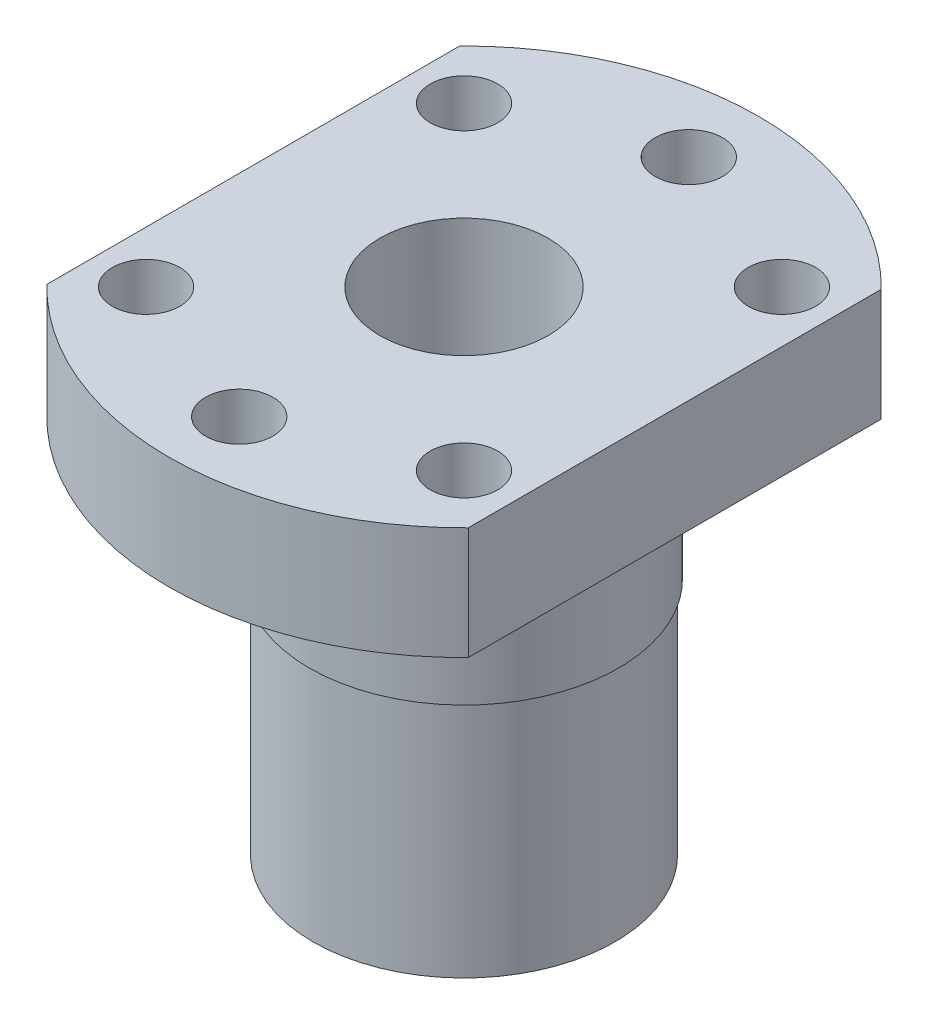
ISO-10303-21;
HEADER;
FILE_DESCRIPTION(('STEP AP214'),'2;1');
FILE_NAME('part.step','',(''),(''),'','','');
FILE_SCHEMA(('AUTOMOTIVE_DESIGN { 1 0 10303 214 1 1 1 1 }'));
ENDSEC;
DATA;
#1=APPLICATION_CONTEXT('core data for automotive mechanical design processes');
#2=APPLICATION_PROTOCOL_DEFINITION('international standard','automotive_design',2000,#1);
#3=PRODUCT_CONTEXT('',#1,'mechanical');
#4=PRODUCT('Part','Part','',(#3));
#5=PRODUCT_RELATED_PRODUCT_CATEGORY('part','',(#4));
#6=PRODUCT_DEFINITION_FORMATION('','',#4);
#7=PRODUCT_DEFINITION_CONTEXT('part definition',#1,'design');
#8=PRODUCT_DEFINITION('design','',#6,#7);
#9=PRODUCT_DEFINITION_SHAPE('','',#8);
#10=(LENGTH_UNIT() NAMED_UNIT(*) SI_UNIT(.MILLI.,.METRE.));
#11=(NAMED_UNIT(*) PLANE_ANGLE_UNIT() SI_UNIT($,.RADIAN.));
#12=(NAMED_UNIT(*) SI_UNIT($,.STERADIAN.) SOLID_ANGLE_UNIT());
#13=UNCERTAINTY_MEASURE_WITH_UNIT(LENGTH_MEASURE(1.E-05),#10,'distance_accuracy_value','');
#14=(GEOMETRIC_REPRESENTATION_CONTEXT(3) GLOBAL_UNCERTAINTY_ASSIGNED_CONTEXT((#13)) GLOBAL_UNIT_ASSIGNED_CONTEXT((#10,
#11,#12)) REPRESENTATION_CONTEXT('',''));
#15=CARTESIAN_POINT('',(0.,0.,0.));
#16=DIRECTION('',(0.,0.,1.));
#17=DIRECTION('',(1.,0.,0.));
#18=AXIS2_PLACEMENT_3D('',#15,#16,#17);
#19=CARTESIAN_POINT('',(0.,-10.,0.));
#20=DIRECTION('',(0.,-1.,0.));
#21=DIRECTION('',(0.,0.,-1.));
#22=AXIS2_PLACEMENT_3D('',#19,#20,#21);
#23=PLANE('',#22);
#24=CARTESIAN_POINT('',(0.,-10.,0.));
#25=DIRECTION('',(0.,-1.,0.));
#26=DIRECTION('',(0.,0.,-1.));
#27=AXIS2_PLACEMENT_3D('',#24,#25,#26);
#28=CIRCLE('',#27,11.);
#29=CARTESIAN_POINT('',(0.,-10.,-11.));
#30=VERTEX_POINT('',#29);
#31=EDGE_CURVE('E168',#30,#30,#28,.T.);
#32=ORIENTED_EDGE('',*,*,#31,.T.);
#33=EDGE_LOOP('',(#32));
#34=FACE_BOUND('',#33,.T.);
#35=CARTESIAN_POINT('',(0.,-10.,0.));
#36=DIRECTION('',(0.,-1.,0.));
#37=DIRECTION('',(0.,0.,-1.));
#38=AXIS2_PLACEMENT_3D('',#35,#36,#37);
#39=CIRCLE('',#38,10.75);
#40=CARTESIAN_POINT('',(0.,-10.,-10.75));
#41=VERTEX_POINT('',#40);
#42=EDGE_CURVE('E165',#41,#41,#39,.T.);
#43=ORIENTED_EDGE('',*,*,#42,.F.);
#44=EDGE_LOOP('',(#43));
#45=FACE_BOUND('',#44,.T.);
#46=ADVANCED_FACE('F32',(#34,#45),#23,.T.);
#47=CARTESIAN_POINT('',(0.,0.,0.));
#48=DIRECTION('',(0.,1.,0.));
#49=DIRECTION('',(0.,0.,1.));
#50=AXIS2_PLACEMENT_3D('',#47,#48,#49);
#51=PLANE('',#50);
#52=CARTESIAN_POINT('',(-11.3137084989848,0.,11.3137084989847));
#53=DIRECTION('',(0.,1.,0.));
#54=DIRECTION('',(0.,0.,-1.));
#55=AXIS2_PLACEMENT_3D('',#52,#53,#54);
#56=CIRCLE('',#55,2.4);
#57=CARTESIAN_POINT('',(-11.3137084989848,0.,8.91370849898474));
#58=VERTEX_POINT('',#57);
#59=EDGE_CURVE('E174',#58,#58,#56,.T.);
#60=ORIENTED_EDGE('',*,*,#59,.T.);
#61=EDGE_LOOP('',(#60));
#62=FACE_BOUND('',#61,.T.);
#63=CARTESIAN_POINT('',(11.3137084989848,0.,11.3137084989847));
#64=DIRECTION('',(0.,1.,0.));
#65=DIRECTION('',(0.,0.,1.));
#66=AXIS2_PLACEMENT_3D('',#63,#64,#65);
#67=CIRCLE('',#66,2.4);
#68=CARTESIAN_POINT('',(11.3137084989848,0.,13.7137084989847));
#69=VERTEX_POINT('',#68);
#70=EDGE_CURVE('E183',#69,#69,#67,.T.);
#71=ORIENTED_EDGE('',*,*,#70,.T.);
#72=EDGE_LOOP('',(#71));
#73=FACE_BOUND('',#72,.T.);
#74=CARTESIAN_POINT('',(-11.3137084989848,0.,-11.3137084989847));
#75=DIRECTION('',(0.,1.,0.));
#76=DIRECTION('',(0.,0.,1.));
#77=AXIS2_PLACEMENT_3D('',#74,#75,#76);
#78=CIRCLE('',#77,2.4);
#79=CARTESIAN_POINT('',(-11.3137084989848,0.,-8.91370849898474));
#80=VERTEX_POINT('',#79);
#81=EDGE_CURVE('E193',#80,#80,#78,.T.);
#82=ORIENTED_EDGE('',*,*,#81,.T.);
#83=EDGE_LOOP('',(#82));
#84=FACE_BOUND('',#83,.T.);
#85=CARTESIAN_POINT('',(0.,0.,0.));
#86=DIRECTION('',(0.,1.,0.));
#87=DIRECTION('',(0.,0.,1.));
#88=AXIS2_PLACEMENT_3D('',#85,#86,#87);
#89=CIRCLE('',#88,21.);
#90=CARTESIAN_POINT('',(-15.,0.,14.6969384566991));
#91=VERTEX_POINT('',#90);
#92=CARTESIAN_POINT('',(15.,0.,14.696938456699));
#93=VERTEX_POINT('',#92);
#94=EDGE_CURVE('E100',#91,#93,#89,.T.);
#95=ORIENTED_EDGE('',*,*,#94,.F.);
#96=DIRECTION('',(0.,0.,1.));
#97=VECTOR('',#96,1.);
#98=CARTESIAN_POINT('',(-15.,0.,-14.6969384566991));
#99=LINE('',#98,#97);
#100=CARTESIAN_POINT('',(-15.,0.,-14.6969384566991));
#101=VERTEX_POINT('',#100);
#102=EDGE_CURVE('E72',#101,#91,#99,.T.);
#103=ORIENTED_EDGE('',*,*,#102,.F.);
#104=CARTESIAN_POINT('',(0.,0.,0.));
#105=DIRECTION('',(0.,1.,0.));
#106=DIRECTION('',(0.,0.,1.));
#107=AXIS2_PLACEMENT_3D('',#104,#105,#106);
#108=CIRCLE('',#107,21.);
#109=CARTESIAN_POINT('',(15.,0.,-14.6969384566991));
#110=VERTEX_POINT('',#109);
#111=EDGE_CURVE('E66',#110,#101,#108,.T.);
#112=ORIENTED_EDGE('',*,*,#111,.F.);
#113=DIRECTION('',(0.,0.,-1.));
#114=VECTOR('',#113,1.);
#115=CARTESIAN_POINT('',(15.,0.,-14.6969384566991));
#116=LINE('',#115,#114);
#117=EDGE_CURVE('E91',#93,#110,#116,.T.);
#118=ORIENTED_EDGE('',*,*,#117,.F.);
#119=EDGE_LOOP('',(#95,#103,#112,#118));
#120=FACE_BOUND('',#119,.T.);
#121=CARTESIAN_POINT('',(0.,0.,-16.));
#122=DIRECTION('',(0.,1.,0.));
#123=DIRECTION('',(0.,0.,1.));
#124=AXIS2_PLACEMENT_3D('',#121,#122,#123);
#125=CIRCLE('',#124,2.4);
#126=CARTESIAN_POINT('',(0.,0.,-13.6));
#127=VERTEX_POINT('',#126);
#128=EDGE_CURVE('E119',#127,#127,#125,.T.);
#129=ORIENTED_EDGE('',*,*,#128,.T.);
#130=EDGE_LOOP('',(#129));
#131=FACE_BOUND('',#130,.T.);
#132=CARTESIAN_POINT('',(11.3137084989848,0.,-11.3137084989847));
#133=DIRECTION('',(0.,1.,0.));
#134=DIRECTION('',(0.,0.,-1.));
#135=AXIS2_PLACEMENT_3D('',#132,#133,#134);
#136=CIRCLE('',#135,2.4);
#137=CARTESIAN_POINT('',(11.3137084989848,0.,-13.7137084989847));
#138=VERTEX_POINT('',#137);
#139=EDGE_CURVE('E123',#138,#138,#136,.T.);
#140=ORIENTED_EDGE('',*,*,#139,.T.);
#141=EDGE_LOOP('',(#140));
#142=FACE_BOUND('',#141,.T.);
#143=CARTESIAN_POINT('',(0.,0.,16.));
#144=DIRECTION('',(0.,1.,0.));
#145=DIRECTION('',(0.,0.,-1.));
#146=AXIS2_PLACEMENT_3D('',#143,#144,#145);
#147=CIRCLE('',#146,2.4);
#148=CARTESIAN_POINT('',(0.,0.,13.6));
#149=VERTEX_POINT('',#148);
#150=EDGE_CURVE('E127',#149,#149,#147,.T.);
#151=ORIENTED_EDGE('',*,*,#150,.T.);
#152=EDGE_LOOP('',(#151));
#153=FACE_BOUND('',#152,.T.);
#154=CARTESIAN_POINT('',(0.,0.,0.));
#155=DIRECTION('',(0.,1.,0.));
#156=DIRECTION('',(0.,0.,1.));
#157=AXIS2_PLACEMENT_3D('',#154,#155,#156);
#158=CIRCLE('',#157,11.);
#159=CARTESIAN_POINT('',(0.,0.,11.));
#160=VERTEX_POINT('',#159);
#161=EDGE_CURVE('E11',#160,#160,#158,.F.);
#162=ORIENTED_EDGE('',*,*,#161,.F.);
#163=EDGE_LOOP('',(#162));
#164=FACE_BOUND('',#163,.T.);
#165=ADVANCED_FACE('F111',(#62,#73,#84,#120,#131,#142,#153,#164),#51,.F.);
#166=CARTESIAN_POINT('',(0.,8.,0.));
#167=DIRECTION('',(0.,1.,0.));
#168=DIRECTION('',(0.,0.,1.));
#169=AXIS2_PLACEMENT_3D('',#166,#167,#168);
#170=PLANE('',#169);
#171=CARTESIAN_POINT('',(0.,8.,16.));
#172=DIRECTION('',(0.,1.,0.));
#173=DIRECTION('',(0.,0.,-1.));
#174=AXIS2_PLACEMENT_3D('',#171,#172,#173);
#175=CIRCLE('',#174,2.4);
#176=CARTESIAN_POINT('',(0.,8.,13.6));
#177=VERTEX_POINT('',#176);
#178=EDGE_CURVE('E180',#177,#177,#175,.T.);
#179=ORIENTED_EDGE('',*,*,#178,.F.);
#180=EDGE_LOOP('',(#179));
#181=FACE_BOUND('',#180,.T.);
#182=CARTESIAN_POINT('',(11.3137084989848,8.,-11.3137084989847));
#183=DIRECTION('',(0.,1.,0.));
#184=DIRECTION('',(0.,0.,-1.));
#185=AXIS2_PLACEMENT_3D('',#182,#183,#184);
#186=CIRCLE('',#185,2.4);
#187=CARTESIAN_POINT('',(11.3137084989848,8.,-13.7137084989847));
#188=VERTEX_POINT('',#187);
#189=EDGE_CURVE('E190',#188,#188,#186,.T.);
#190=ORIENTED_EDGE('',*,*,#189,.F.);
#191=EDGE_LOOP('',(#190));
#192=FACE_BOUND('',#191,.T.);
#193=CARTESIAN_POINT('',(0.,8.,-16.));
#194=DIRECTION('',(0.,1.,0.));
#195=DIRECTION('',(0.,0.,1.));
#196=AXIS2_PLACEMENT_3D('',#193,#194,#195);
#197=CIRCLE('',#196,2.4);
#198=CARTESIAN_POINT('',(0.,8.,-13.6));
#199=VERTEX_POINT('',#198);
#200=EDGE_CURVE('E200',#199,#199,#197,.T.);
#201=ORIENTED_EDGE('',*,*,#200,.F.);
#202=EDGE_LOOP('',(#201));
#203=FACE_BOUND('',#202,.T.);
#204=CARTESIAN_POINT('',(0.,8.,0.));
#205=DIRECTION('',(0.,1.,0.));
#206=DIRECTION('',(0.,0.,1.));
#207=AXIS2_PLACEMENT_3D('',#204,#205,#206);
#208=CIRCLE('',#207,21.);
#209=CARTESIAN_POINT('',(-15.,8.,14.6969384566991));
#210=VERTEX_POINT('',#209);
#211=CARTESIAN_POINT('',(15.,8.,14.696938456699));
#212=VERTEX_POINT('',#211);
#213=EDGE_CURVE('E86',#210,#212,#208,.T.);
#214=ORIENTED_EDGE('',*,*,#213,.T.);
#215=DIRECTION('',(0.,0.,-1.));
#216=VECTOR('',#215,1.);
#217=CARTESIAN_POINT('',(15.,8.,-14.6969384566991));
#218=LINE('',#217,#216);
#219=CARTESIAN_POINT('',(15.,8.,-14.6969384566991));
#220=VERTEX_POINT('',#219);
#221=EDGE_CURVE('E80',#212,#220,#218,.T.);
#222=ORIENTED_EDGE('',*,*,#221,.T.);
#223=CARTESIAN_POINT('',(0.,8.,0.));
#224=DIRECTION('',(0.,1.,0.));
#225=DIRECTION('',(0.,0.,1.));
#226=AXIS2_PLACEMENT_3D('',#223,#224,#225);
#227=CIRCLE('',#226,21.);
#228=CARTESIAN_POINT('',(-15.,8.,-14.6969384566991));
#229=VERTEX_POINT('',#228);
#230=EDGE_CURVE('E84',#220,#229,#227,.T.);
#231=ORIENTED_EDGE('',*,*,#230,.T.);
#232=DIRECTION('',(0.,0.,1.));
#233=VECTOR('',#232,1.);
#234=CARTESIAN_POINT('',(-15.,8.,-14.6969384566991));
#235=LINE('',#234,#233);
#236=EDGE_CURVE('E49',#229,#210,#235,.T.);
#237=ORIENTED_EDGE('',*,*,#236,.T.);
#238=EDGE_LOOP('',(#214,#222,#231,#237));
#239=FACE_BOUND('',#238,.T.);
#240=CARTESIAN_POINT('',(0.,8.,0.));
#241=DIRECTION('',(0.,1.,0.));
#242=DIRECTION('',(0.,0.,1.));
#243=AXIS2_PLACEMENT_3D('',#240,#241,#242);
#244=CIRCLE('',#243,6.);
#245=CARTESIAN_POINT('',(0.,8.,6.));
#246=VERTEX_POINT('',#245);
#247=EDGE_CURVE('E103',#246,#246,#244,.T.);
#248=ORIENTED_EDGE('',*,*,#247,.F.);
#249=EDGE_LOOP('',(#248));
#250=FACE_BOUND('',#249,.T.);
#251=CARTESIAN_POINT('',(-11.3137084989848,8.,-11.3137084989847));
#252=DIRECTION('',(0.,1.,0.));
#253=DIRECTION('',(0.,0.,1.));
#254=AXIS2_PLACEMENT_3D('',#251,#252,#253);
#255=CIRCLE('',#254,2.4);
#256=CARTESIAN_POINT('',(-11.3137084989848,8.,-8.91370849898474));
#257=VERTEX_POINT('',#256);
#258=EDGE_CURVE('E195',#257,#257,#255,.T.);
#259=ORIENTED_EDGE('',*,*,#258,.F.);
#260=EDGE_LOOP('',(#259));
#261=FACE_BOUND('',#260,.T.);
#262=CARTESIAN_POINT('',(11.3137084989848,8.,11.3137084989847));
#263=DIRECTION('',(0.,1.,0.));
#264=DIRECTION('',(0.,0.,1.));
#265=AXIS2_PLACEMENT_3D('',#262,#263,#264);
#266=CIRCLE('',#265,2.4);
#267=CARTESIAN_POINT('',(11.3137084989848,8.,13.7137084989847));
#268=VERTEX_POINT('',#267);
#269=EDGE_CURVE('E185',#268,#268,#266,.T.);
#270=ORIENTED_EDGE('',*,*,#269,.F.);
#271=EDGE_LOOP('',(#270));
#272=FACE_BOUND('',#271,.T.);
#273=CARTESIAN_POINT('',(-11.3137084989848,8.,11.3137084989847));
#274=DIRECTION('',(0.,1.,0.));
#275=DIRECTION('',(0.,0.,-1.));
#276=AXIS2_PLACEMENT_3D('',#273,#274,#275);
#277=CIRCLE('',#276,2.4);
#278=CARTESIAN_POINT('',(-11.3137084989848,8.,8.91370849898474));
#279=VERTEX_POINT('',#278);
#280=EDGE_CURVE('E175',#279,#279,#277,.T.);
#281=ORIENTED_EDGE('',*,*,#280,.F.);
#282=EDGE_LOOP('',(#281));
#283=FACE_BOUND('',#282,.T.);
#284=ADVANCED_FACE('F81',(#181,#192,#203,#239,#250,#261,#272,#283),#170,.T.);
#285=CARTESIAN_POINT('',(0.,8.,0.));
#286=DIRECTION('',(0.,-1.,0.));
#287=DIRECTION('',(0.,0.,-1.));
#288=AXIS2_PLACEMENT_3D('',#285,#286,#287);
#289=CYLINDRICAL_SURFACE('',#288,21.);
#290=ORIENTED_EDGE('',*,*,#94,.T.);
#291=DIRECTION('',(0.,-1.,0.));
#292=VECTOR('',#291,1.);
#293=CARTESIAN_POINT('',(15.,8.,14.696938456699));
#294=LINE('',#293,#292);
#295=EDGE_CURVE('E41',#212,#93,#294,.T.);
#296=ORIENTED_EDGE('',*,*,#295,.F.);
#297=ORIENTED_EDGE('',*,*,#213,.F.);
#298=DIRECTION('',(0.,-1.,0.));
#299=VECTOR('',#298,1.);
#300=CARTESIAN_POINT('',(-15.,8.,14.6969384566991));
#301=LINE('',#300,#299);
#302=EDGE_CURVE('E96',#210,#91,#301,.T.);
#303=ORIENTED_EDGE('',*,*,#302,.T.);
#304=EDGE_LOOP('',(#290,#296,#297,#303));
#305=FACE_BOUND('',#304,.T.);
#306=ADVANCED_FACE('F34',(#305),#289,.T.);
#307=CARTESIAN_POINT('',(15.,8.,-14.6969384566991));
#308=DIRECTION('',(-1.,0.,0.));
#309=DIRECTION('',(0.,0.,1.));
#310=AXIS2_PLACEMENT_3D('',#307,#308,#309);
#311=PLANE('',#310);
#312=ORIENTED_EDGE('',*,*,#117,.T.);
#313=DIRECTION('',(0.,-1.,0.));
#314=VECTOR('',#313,1.);
#315=CARTESIAN_POINT('',(15.,8.,-14.6969384566991));
#316=LINE('',#315,#314);
#317=EDGE_CURVE('E89',#220,#110,#316,.T.);
#318=ORIENTED_EDGE('',*,*,#317,.F.);
#319=ORIENTED_EDGE('',*,*,#221,.F.);
#320=ORIENTED_EDGE('',*,*,#295,.T.);
#321=EDGE_LOOP('',(#312,#318,#319,#320));
#322=FACE_BOUND('',#321,.T.);
#323=ADVANCED_FACE('F90',(#322),#311,.F.);
#324=CARTESIAN_POINT('',(0.,8.,0.));
#325=DIRECTION('',(0.,-1.,0.));
#326=DIRECTION('',(0.,0.,-1.));
#327=AXIS2_PLACEMENT_3D('',#324,#325,#326);
#328=CYLINDRICAL_SURFACE('',#327,21.);
#329=ORIENTED_EDGE('',*,*,#111,.T.);
#330=DIRECTION('',(0.,-1.,0.));
#331=VECTOR('',#330,1.);
#332=CARTESIAN_POINT('',(-15.,8.,-14.6969384566991));
#333=LINE('',#332,#331);
#334=EDGE_CURVE('E92',#229,#101,#333,.T.);
#335=ORIENTED_EDGE('',*,*,#334,.F.);
#336=ORIENTED_EDGE('',*,*,#230,.F.);
#337=ORIENTED_EDGE('',*,*,#317,.T.);
#338=EDGE_LOOP('',(#329,#335,#336,#337));
#339=FACE_BOUND('',#338,.T.);
#340=ADVANCED_FACE('F94',(#339),#328,.T.);
#341=CARTESIAN_POINT('',(-15.,8.,-14.6969384566991));
#342=DIRECTION('',(1.,0.,0.));
#343=DIRECTION('',(0.,0.,-1.));
#344=AXIS2_PLACEMENT_3D('',#341,#342,#343);
#345=PLANE('',#344);
#346=ORIENTED_EDGE('',*,*,#102,.T.);
#347=ORIENTED_EDGE('',*,*,#302,.F.);
#348=ORIENTED_EDGE('',*,*,#236,.F.);
#349=ORIENTED_EDGE('',*,*,#334,.T.);
#350=EDGE_LOOP('',(#346,#347,#348,#349));
#351=FACE_BOUND('',#350,.T.);
#352=ADVANCED_FACE('F243',(#351),#345,.F.);
#353=CARTESIAN_POINT('',(0.,8.,0.));
#354=DIRECTION('',(0.,-1.,0.));
#355=DIRECTION('',(0.,0.,-1.));
#356=AXIS2_PLACEMENT_3D('',#353,#354,#355);
#357=CYLINDRICAL_SURFACE('',#356,6.);
#358=ORIENTED_EDGE('',*,*,#247,.T.);
#359=EDGE_LOOP('',(#358));
#360=FACE_BOUND('',#359,.T.);
#361=CARTESIAN_POINT('',(0.,-27.,0.));
#362=DIRECTION('',(0.,-1.,0.));
#363=DIRECTION('',(0.,0.,-1.));
#364=AXIS2_PLACEMENT_3D('',#361,#362,#363);
#365=CIRCLE('',#364,6.);
#366=CARTESIAN_POINT('',(0.,-27.,-6.));
#367=VERTEX_POINT('',#366);
#368=EDGE_CURVE('E166',#367,#367,#365,.T.);
#369=ORIENTED_EDGE('',*,*,#368,.T.);
#370=EDGE_LOOP('',(#369));
#371=FACE_BOUND('',#370,.T.);
#372=ADVANCED_FACE('F207',(#360,#371),#357,.F.);
#373=CARTESIAN_POINT('',(0.,8.,-16.));
#374=DIRECTION('',(0.,-1.,0.));
#375=DIRECTION('',(0.,0.,-1.));
#376=AXIS2_PLACEMENT_3D('',#373,#374,#375);
#377=CYLINDRICAL_SURFACE('',#376,2.4);
#378=ORIENTED_EDGE('',*,*,#200,.T.);
#379=EDGE_LOOP('',(#378));
#380=FACE_BOUND('',#379,.T.);
#381=ORIENTED_EDGE('',*,*,#128,.F.);
#382=EDGE_LOOP('',(#381));
#383=FACE_BOUND('',#382,.T.);
#384=ADVANCED_FACE('F228',(#380,#383),#377,.F.);
#385=CARTESIAN_POINT('',(-11.3137084989848,8.,-11.3137084989847));
#386=DIRECTION('',(0.,-1.,0.));
#387=DIRECTION('',(0.,0.,-1.));
#388=AXIS2_PLACEMENT_3D('',#385,#386,#387);
#389=CYLINDRICAL_SURFACE('',#388,2.4);
#390=ORIENTED_EDGE('',*,*,#258,.T.);
#391=EDGE_LOOP('',(#390));
#392=FACE_BOUND('',#391,.T.);
#393=ORIENTED_EDGE('',*,*,#81,.F.);
#394=EDGE_LOOP('',(#393));
#395=FACE_BOUND('',#394,.T.);
#396=ADVANCED_FACE('F225',(#392,#395),#389,.F.);
#397=CARTESIAN_POINT('',(11.3137084989848,8.,-11.3137084989847));
#398=DIRECTION('',(0.,-1.,0.));
#399=DIRECTION('',(0.,0.,-1.));
#400=AXIS2_PLACEMENT_3D('',#397,#398,#399);
#401=CYLINDRICAL_SURFACE('',#400,2.4);
#402=ORIENTED_EDGE('',*,*,#189,.T.);
#403=EDGE_LOOP('',(#402));
#404=FACE_BOUND('',#403,.T.);
#405=ORIENTED_EDGE('',*,*,#139,.F.);
#406=EDGE_LOOP('',(#405));
#407=FACE_BOUND('',#406,.T.);
#408=ADVANCED_FACE('F227',(#404,#407),#401,.F.);
#409=CARTESIAN_POINT('',(11.3137084989848,8.,11.3137084989847));
#410=DIRECTION('',(0.,-1.,0.));
#411=DIRECTION('',(0.,0.,-1.));
#412=AXIS2_PLACEMENT_3D('',#409,#410,#411);
#413=CYLINDRICAL_SURFACE('',#412,2.4);
#414=ORIENTED_EDGE('',*,*,#269,.T.);
#415=EDGE_LOOP('',(#414));
#416=FACE_BOUND('',#415,.T.);
#417=ORIENTED_EDGE('',*,*,#70,.F.);
#418=EDGE_LOOP('',(#417));
#419=FACE_BOUND('',#418,.T.);
#420=ADVANCED_FACE('F235',(#416,#419),#413,.F.);
#421=CARTESIAN_POINT('',(0.,8.,16.));
#422=DIRECTION('',(0.,-1.,0.));
#423=DIRECTION('',(0.,0.,-1.));
#424=AXIS2_PLACEMENT_3D('',#421,#422,#423);
#425=CYLINDRICAL_SURFACE('',#424,2.4);
#426=ORIENTED_EDGE('',*,*,#178,.T.);
#427=EDGE_LOOP('',(#426));
#428=FACE_BOUND('',#427,.T.);
#429=ORIENTED_EDGE('',*,*,#150,.F.);
#430=EDGE_LOOP('',(#429));
#431=FACE_BOUND('',#430,.T.);
#432=ADVANCED_FACE('F143',(#428,#431),#425,.F.);
#433=CARTESIAN_POINT('',(-11.3137084989848,8.,11.3137084989847));
#434=DIRECTION('',(0.,-1.,0.));
#435=DIRECTION('',(0.,0.,-1.));
#436=AXIS2_PLACEMENT_3D('',#433,#434,#435);
#437=CYLINDRICAL_SURFACE('',#436,2.4);
#438=ORIENTED_EDGE('',*,*,#280,.T.);
#439=EDGE_LOOP('',(#438));
#440=FACE_BOUND('',#439,.T.);
#441=ORIENTED_EDGE('',*,*,#59,.F.);
#442=EDGE_LOOP('',(#441));
#443=FACE_BOUND('',#442,.T.);
#444=ADVANCED_FACE('F133',(#440,#443),#437,.F.);
#445=CARTESIAN_POINT('',(0.,-10.,0.));
#446=DIRECTION('',(0.,1.,0.));
#447=DIRECTION('',(0.,0.,1.));
#448=AXIS2_PLACEMENT_3D('',#445,#446,#447);
#449=CYLINDRICAL_SURFACE('',#448,11.);
#450=ORIENTED_EDGE('',*,*,#31,.F.);
#451=EDGE_LOOP('',(#450));
#452=FACE_BOUND('',#451,.T.);
#453=ORIENTED_EDGE('',*,*,#161,.T.);
#454=EDGE_LOOP('',(#453));
#455=FACE_BOUND('',#454,.T.);
#456=ADVANCED_FACE('F130',(#452,#455),#449,.T.);
#457=CARTESIAN_POINT('',(0.,-27.,0.));
#458=DIRECTION('',(0.,-1.,0.));
#459=DIRECTION('',(0.,0.,-1.));
#460=AXIS2_PLACEMENT_3D('',#457,#458,#459);
#461=PLANE('',#460);
#462=CARTESIAN_POINT('',(0.,-27.,0.));
#463=DIRECTION('',(0.,-1.,0.));
#464=DIRECTION('',(0.,0.,-1.));
#465=AXIS2_PLACEMENT_3D('',#462,#463,#464);
#466=CIRCLE('',#465,10.75);
#467=CARTESIAN_POINT('',(0.,-27.,-10.75));
#468=VERTEX_POINT('',#467);
#469=EDGE_CURVE('E162',#468,#468,#466,.T.);
#470=ORIENTED_EDGE('',*,*,#469,.T.);
#471=EDGE_LOOP('',(#470));
#472=FACE_BOUND('',#471,.T.);
#473=ORIENTED_EDGE('',*,*,#368,.F.);
#474=EDGE_LOOP('',(#473));
#475=FACE_BOUND('',#474,.T.);
#476=ADVANCED_FACE('F132',(#472,#475),#461,.T.);
#477=CARTESIAN_POINT('',(0.,-27.,0.));
#478=DIRECTION('',(0.,1.,0.));
#479=DIRECTION('',(0.,0.,1.));
#480=AXIS2_PLACEMENT_3D('',#477,#478,#479);
#481=CYLINDRICAL_SURFACE('',#480,10.75);
#482=ORIENTED_EDGE('',*,*,#469,.F.);
#483=EDGE_LOOP('',(#482));
#484=FACE_BOUND('',#483,.T.);
#485=ORIENTED_EDGE('',*,*,#42,.T.);
#486=EDGE_LOOP('',(#485));
#487=FACE_BOUND('',#486,.T.);
#488=ADVANCED_FACE('F140',(#484,#487),#481,.T.);
#489=CLOSED_SHELL('',(#46,#165,#284,#306,#323,#340,#352,#372,#384,#396,#408,#420,#432,#444,#456,
#476,#488));
#490=MANIFOLD_SOLID_BREP('B2',#489);
#491=ADVANCED_BREP_SHAPE_REPRESENTATION('',(#18,#490),#14);
#492=SHAPE_DEFINITION_REPRESENTATION(#9,#491);
ENDSEC;
END-ISO-10303-21;
